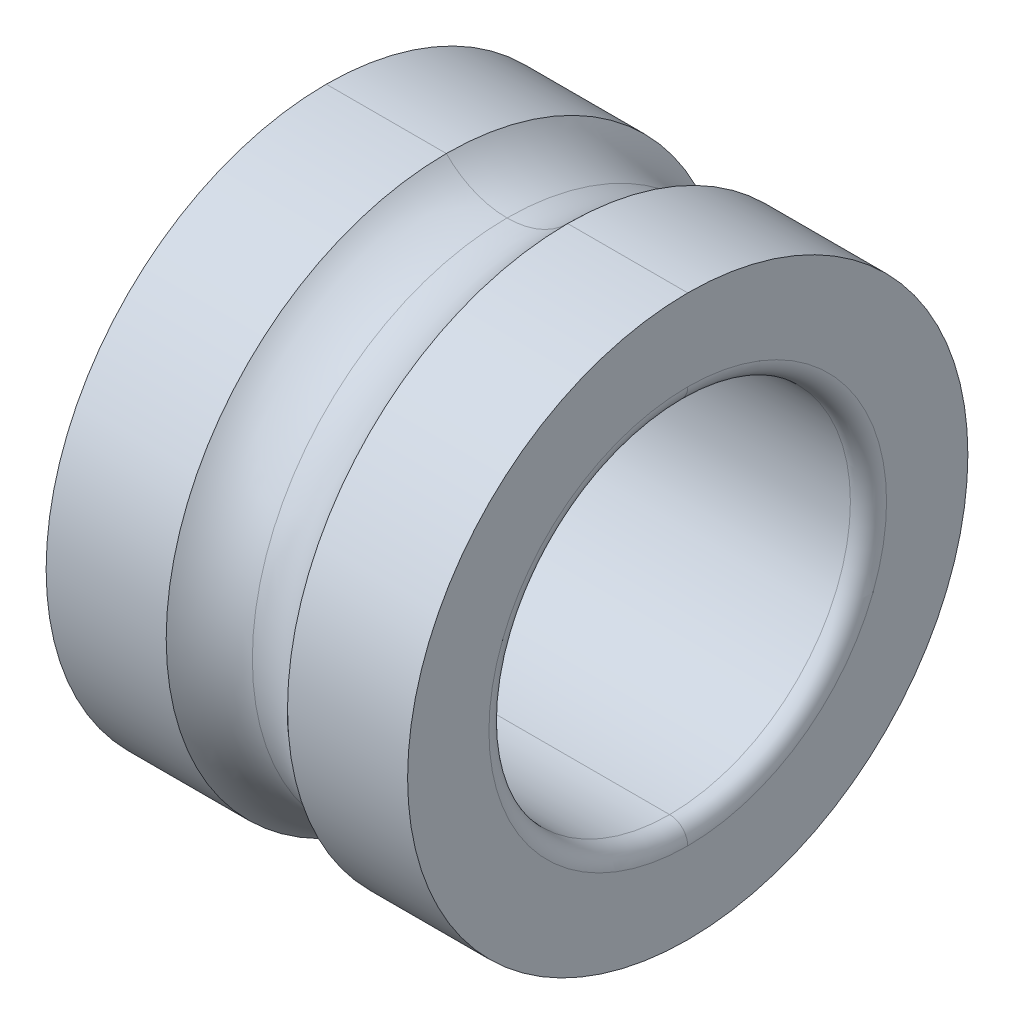
ISO-10303-21;
HEADER;
FILE_DESCRIPTION(('STEP AP214'),'2;1');
FILE_NAME('part.step','',(''),(''),'','','');
FILE_SCHEMA(('AUTOMOTIVE_DESIGN { 1 0 10303 214 1 1 1 1 }'));
ENDSEC;
DATA;
#1=APPLICATION_CONTEXT('core data for automotive mechanical design processes');
#2=APPLICATION_PROTOCOL_DEFINITION('international standard','automotive_design',2000,#1);
#3=PRODUCT_CONTEXT('',#1,'mechanical');
#4=PRODUCT('Part','Part','',(#3));
#5=PRODUCT_RELATED_PRODUCT_CATEGORY('part','',(#4));
#6=PRODUCT_DEFINITION_FORMATION('','',#4);
#7=PRODUCT_DEFINITION_CONTEXT('part definition',#1,'design');
#8=PRODUCT_DEFINITION('design','',#6,#7);
#9=PRODUCT_DEFINITION_SHAPE('','',#8);
#10=(LENGTH_UNIT() NAMED_UNIT(*) SI_UNIT(.MILLI.,.METRE.));
#11=(NAMED_UNIT(*) PLANE_ANGLE_UNIT() SI_UNIT($,.RADIAN.));
#12=(NAMED_UNIT(*) SI_UNIT($,.STERADIAN.) SOLID_ANGLE_UNIT());
#13=UNCERTAINTY_MEASURE_WITH_UNIT(LENGTH_MEASURE(1.E-05),#10,'distance_accuracy_value','');
#14=(GEOMETRIC_REPRESENTATION_CONTEXT(3) GLOBAL_UNCERTAINTY_ASSIGNED_CONTEXT((#13)) GLOBAL_UNIT_ASSIGNED_CONTEXT((#10,
#11,#12)) REPRESENTATION_CONTEXT('',''));
#15=CARTESIAN_POINT('',(0.,0.,0.));
#16=DIRECTION('',(0.,0.,1.));
#17=DIRECTION('',(1.,0.,0.));
#18=AXIS2_PLACEMENT_3D('',#15,#16,#17);
#19=CARTESIAN_POINT('',(-1.79451,0.,0.));
#20=DIRECTION('',(1.,0.,0.));
#21=DIRECTION('',(0.,-1.,0.));
#22=AXIS2_PLACEMENT_3D('',#19,#20,#21);
#23=TOROIDAL_SURFACE('',#22,2.19329,0.19939);
#24=CARTESIAN_POINT('',(-1.9939,0.,0.));
#25=DIRECTION('',(-1.,0.,0.));
#26=DIRECTION('',(0.,1.,0.));
#27=AXIS2_PLACEMENT_3D('',#24,#25,#26);
#28=CIRCLE('',#27,2.19329);
#29=CARTESIAN_POINT('',(-1.9939,2.19329,0.));
#30=VERTEX_POINT('',#29);
#31=CARTESIAN_POINT('',(-1.9939,-2.19329,0.));
#32=VERTEX_POINT('',#31);
#33=EDGE_CURVE('E111',#30,#32,#28,.T.);
#34=ORIENTED_EDGE('',*,*,#33,.T.);
#35=CARTESIAN_POINT('',(-1.79451,-2.19329,0.));
#36=DIRECTION('',(0.,0.,-1.));
#37=DIRECTION('',(-1.,0.,0.));
#38=AXIS2_PLACEMENT_3D('',#35,#36,#37);
#39=CIRCLE('',#38,0.19939);
#40=CARTESIAN_POINT('',(-1.79451,-1.9939,0.));
#41=VERTEX_POINT('',#40);
#42=EDGE_CURVE('E28',#32,#41,#39,.T.);
#43=ORIENTED_EDGE('',*,*,#42,.T.);
#44=CARTESIAN_POINT('',(-1.79451,0.,0.));
#45=DIRECTION('',(-1.,0.,0.));
#46=DIRECTION('',(0.,1.,0.));
#47=AXIS2_PLACEMENT_3D('',#44,#45,#46);
#48=CIRCLE('',#47,1.9939);
#49=CARTESIAN_POINT('',(-1.79451,1.9939,0.));
#50=VERTEX_POINT('',#49);
#51=EDGE_CURVE('E174',#50,#41,#48,.T.);
#52=ORIENTED_EDGE('',*,*,#51,.F.);
#53=CARTESIAN_POINT('',(-1.79451,2.19329,0.));
#54=DIRECTION('',(0.,0.,1.));
#55=DIRECTION('',(-1.,0.,0.));
#56=AXIS2_PLACEMENT_3D('',#53,#54,#55);
#57=CIRCLE('',#56,0.19939);
#58=EDGE_CURVE('E11',#30,#50,#57,.T.);
#59=ORIENTED_EDGE('',*,*,#58,.F.);
#60=EDGE_LOOP('',(#34,#43,#52,#59));
#61=FACE_BOUND('',#60,.T.);
#62=ADVANCED_FACE('F17',(#61),#23,.T.);
#63=CARTESIAN_POINT('',(-1.79451,0.,0.));
#64=DIRECTION('',(1.,0.,0.));
#65=DIRECTION('',(0.,-1.,0.));
#66=AXIS2_PLACEMENT_3D('',#63,#64,#65);
#67=TOROIDAL_SURFACE('',#66,2.19329,0.19939);
#68=CARTESIAN_POINT('',(-1.79451,0.,0.));
#69=DIRECTION('',(1.,0.,0.));
#70=DIRECTION('',(0.,1.,0.));
#71=AXIS2_PLACEMENT_3D('',#68,#69,#70);
#72=CIRCLE('',#71,1.9939);
#73=EDGE_CURVE('E151',#50,#41,#72,.T.);
#74=ORIENTED_EDGE('',*,*,#73,.T.);
#75=ORIENTED_EDGE('',*,*,#42,.F.);
#76=CARTESIAN_POINT('',(-1.9939,0.,0.));
#77=DIRECTION('',(1.,0.,0.));
#78=DIRECTION('',(0.,1.,0.));
#79=AXIS2_PLACEMENT_3D('',#76,#77,#78);
#80=CIRCLE('',#79,2.19329);
#81=EDGE_CURVE('E182',#30,#32,#80,.T.);
#82=ORIENTED_EDGE('',*,*,#81,.F.);
#83=ORIENTED_EDGE('',*,*,#58,.T.);
#84=EDGE_LOOP('',(#74,#75,#82,#83));
#85=FACE_BOUND('',#84,.T.);
#86=ADVANCED_FACE('F19',(#85),#67,.T.);
#87=CARTESIAN_POINT('',(-1.9939,0.,0.));
#88=DIRECTION('',(1.,0.,0.));
#89=DIRECTION('',(0.,1.,0.));
#90=AXIS2_PLACEMENT_3D('',#87,#88,#89);
#91=PLANE('',#90);
#92=ORIENTED_EDGE('',*,*,#33,.F.);
#93=ORIENTED_EDGE('',*,*,#81,.T.);
#94=EDGE_LOOP('',(#92,#93));
#95=FACE_BOUND('',#94,.T.);
#96=CARTESIAN_POINT('',(-1.9939,0.,0.));
#97=DIRECTION('',(1.,0.,0.));
#98=DIRECTION('',(0.,1.,0.));
#99=AXIS2_PLACEMENT_3D('',#96,#97,#98);
#100=CIRCLE('',#99,3.0905069);
#101=CARTESIAN_POINT('',(-1.9939,3.0905069,0.));
#102=VERTEX_POINT('',#101);
#103=CARTESIAN_POINT('',(-1.9939,-3.0905069,0.));
#104=VERTEX_POINT('',#103);
#105=EDGE_CURVE('E115',#102,#104,#100,.T.);
#106=ORIENTED_EDGE('',*,*,#105,.F.);
#107=CARTESIAN_POINT('',(-1.9939,0.,0.));
#108=DIRECTION('',(-1.,0.,0.));
#109=DIRECTION('',(0.,1.,0.));
#110=AXIS2_PLACEMENT_3D('',#107,#108,#109);
#111=CIRCLE('',#110,3.0905069);
#112=EDGE_CURVE('E104',#102,#104,#111,.T.);
#113=ORIENTED_EDGE('',*,*,#112,.T.);
#114=EDGE_LOOP('',(#106,#113));
#115=FACE_BOUND('',#114,.T.);
#116=ADVANCED_FACE('F121',(#95,#115),#91,.F.);
#117=CARTESIAN_POINT('',(-2.19329,0.,0.));
#118=DIRECTION('',(1.,0.,0.));
#119=DIRECTION('',(0.,-1.,0.));
#120=AXIS2_PLACEMENT_3D('',#117,#118,#119);
#121=CYLINDRICAL_SURFACE('',#120,3.0905069);
#122=CARTESIAN_POINT('',(-0.669246824752564,0.,0.));
#123=DIRECTION('',(-1.,0.,0.));
#124=DIRECTION('',(0.,1.,0.));
#125=AXIS2_PLACEMENT_3D('',#122,#123,#124);
#126=CIRCLE('',#125,3.0905069);
#127=CARTESIAN_POINT('',(-0.669246824752564,3.0905069,0.));
#128=VERTEX_POINT('',#127);
#129=CARTESIAN_POINT('',(-0.669246824752564,-3.0905069,0.));
#130=VERTEX_POINT('',#129);
#131=EDGE_CURVE('E139',#128,#130,#126,.T.);
#132=ORIENTED_EDGE('',*,*,#131,.T.);
#133=DIRECTION('',(-1.,0.,0.));
#134=VECTOR('',#133,1.);
#135=CARTESIAN_POINT('',(-0.669246824752564,-3.0905069,0.));
#136=LINE('',#135,#134);
#137=EDGE_CURVE('E106',#130,#104,#136,.T.);
#138=ORIENTED_EDGE('',*,*,#137,.T.);
#139=ORIENTED_EDGE('',*,*,#112,.F.);
#140=DIRECTION('',(-1.,0.,0.));
#141=VECTOR('',#140,1.);
#142=CARTESIAN_POINT('',(-0.669246824752564,3.0905069,0.));
#143=LINE('',#142,#141);
#144=EDGE_CURVE('E98',#128,#102,#143,.T.);
#145=ORIENTED_EDGE('',*,*,#144,.F.);
#146=EDGE_LOOP('',(#132,#138,#139,#145));
#147=FACE_BOUND('',#146,.T.);
#148=ADVANCED_FACE('F105',(#147),#121,.T.);
#149=CARTESIAN_POINT('',(-2.19329,0.,0.));
#150=DIRECTION('',(1.,0.,0.));
#151=DIRECTION('',(0.,-1.,0.));
#152=AXIS2_PLACEMENT_3D('',#149,#150,#151);
#153=CYLINDRICAL_SURFACE('',#152,3.0905069);
#154=ORIENTED_EDGE('',*,*,#105,.T.);
#155=ORIENTED_EDGE('',*,*,#137,.F.);
#156=CARTESIAN_POINT('',(-0.669246824752564,0.,0.));
#157=DIRECTION('',(1.,0.,0.));
#158=DIRECTION('',(0.,1.,0.));
#159=AXIS2_PLACEMENT_3D('',#156,#157,#158);
#160=CIRCLE('',#159,3.0905069);
#161=EDGE_CURVE('E117',#128,#130,#160,.T.);
#162=ORIENTED_EDGE('',*,*,#161,.F.);
#163=ORIENTED_EDGE('',*,*,#144,.T.);
#164=EDGE_LOOP('',(#154,#155,#162,#163));
#165=FACE_BOUND('',#164,.T.);
#166=ADVANCED_FACE('F114',(#165),#153,.T.);
#167=CARTESIAN_POINT('',(0.,0.,0.));
#168=DIRECTION('',(1.,0.,0.));
#169=DIRECTION('',(0.,-1.,0.));
#170=AXIS2_PLACEMENT_3D('',#167,#168,#169);
#171=TOROIDAL_SURFACE('',#170,3.7465,0.937133);
#172=CARTESIAN_POINT('',(0.,0.,0.));
#173=DIRECTION('',(1.,0.,0.));
#174=DIRECTION('',(0.,0.,-1.));
#175=AXIS2_PLACEMENT_3D('',#172,#173,#174);
#176=CIRCLE('',#175,2.809367);
#177=CARTESIAN_POINT('',(0.,2.809367,0.));
#178=VERTEX_POINT('',#177);
#179=CARTESIAN_POINT('',(0.,-2.809367,0.));
#180=VERTEX_POINT('',#179);
#181=EDGE_CURVE('E155',#178,#180,#176,.T.);
#182=ORIENTED_EDGE('',*,*,#181,.F.);
#183=CARTESIAN_POINT('',(0.,3.7465,0.));
#184=DIRECTION('',(0.,0.,-1.));
#185=DIRECTION('',(0.714142842854284,-0.7,0.));
#186=AXIS2_PLACEMENT_3D('',#183,#184,#185);
#187=CIRCLE('',#186,0.937133);
#188=EDGE_CURVE('E130',#178,#128,#187,.T.);
#189=ORIENTED_EDGE('',*,*,#188,.T.);
#190=ORIENTED_EDGE('',*,*,#161,.T.);
#191=CARTESIAN_POINT('',(0.,-3.7465,0.));
#192=DIRECTION('',(0.,0.,1.));
#193=DIRECTION('',(0.714142842854284,0.7,0.));
#194=AXIS2_PLACEMENT_3D('',#191,#192,#193);
#195=CIRCLE('',#194,0.937133);
#196=EDGE_CURVE('E135',#180,#130,#195,.T.);
#197=ORIENTED_EDGE('',*,*,#196,.F.);
#198=EDGE_LOOP('',(#182,#189,#190,#197));
#199=FACE_BOUND('',#198,.T.);
#200=ADVANCED_FACE('F267',(#199),#171,.F.);
#201=CARTESIAN_POINT('',(0.,0.,0.));
#202=DIRECTION('',(1.,0.,0.));
#203=DIRECTION('',(0.,-1.,0.));
#204=AXIS2_PLACEMENT_3D('',#201,#202,#203);
#205=TOROIDAL_SURFACE('',#204,3.7465,0.937133);
#206=CARTESIAN_POINT('',(0.,0.,0.));
#207=DIRECTION('',(1.,0.,0.));
#208=DIRECTION('',(0.,0.,-1.));
#209=AXIS2_PLACEMENT_3D('',#206,#207,#208);
#210=CIRCLE('',#209,2.809367);
#211=EDGE_CURVE('E165',#180,#178,#210,.T.);
#212=ORIENTED_EDGE('',*,*,#211,.F.);
#213=ORIENTED_EDGE('',*,*,#196,.T.);
#214=ORIENTED_EDGE('',*,*,#131,.F.);
#215=ORIENTED_EDGE('',*,*,#188,.F.);
#216=EDGE_LOOP('',(#212,#213,#214,#215));
#217=FACE_BOUND('',#216,.T.);
#218=ADVANCED_FACE('F271',(#217),#205,.F.);
#219=CARTESIAN_POINT('',(-2.19329,0.,0.));
#220=DIRECTION('',(1.,0.,0.));
#221=DIRECTION('',(0.,-1.,0.));
#222=AXIS2_PLACEMENT_3D('',#219,#220,#221);
#223=CYLINDRICAL_SURFACE('',#222,3.0905069);
#224=CARTESIAN_POINT('',(1.9939,0.,0.));
#225=DIRECTION('',(-1.,0.,0.));
#226=DIRECTION('',(0.,1.,0.));
#227=AXIS2_PLACEMENT_3D('',#224,#225,#226);
#228=CIRCLE('',#227,3.0905069);
#229=CARTESIAN_POINT('',(1.9939,3.0905069,0.));
#230=VERTEX_POINT('',#229);
#231=CARTESIAN_POINT('',(1.9939,-3.0905069,0.));
#232=VERTEX_POINT('',#231);
#233=EDGE_CURVE('E193',#230,#232,#228,.T.);
#234=ORIENTED_EDGE('',*,*,#233,.T.);
#235=DIRECTION('',(-1.,0.,0.));
#236=VECTOR('',#235,1.);
#237=CARTESIAN_POINT('',(1.9939,-3.0905069,0.));
#238=LINE('',#237,#236);
#239=CARTESIAN_POINT('',(0.669246824752564,-3.0905069,0.));
#240=VERTEX_POINT('',#239);
#241=EDGE_CURVE('E178',#232,#240,#238,.T.);
#242=ORIENTED_EDGE('',*,*,#241,.T.);
#243=CARTESIAN_POINT('',(0.669246824752564,0.,0.));
#244=DIRECTION('',(-1.,0.,0.));
#245=DIRECTION('',(0.,1.,0.));
#246=AXIS2_PLACEMENT_3D('',#243,#244,#245);
#247=CIRCLE('',#246,3.0905069);
#248=CARTESIAN_POINT('',(0.669246824752564,3.0905069,0.));
#249=VERTEX_POINT('',#248);
#250=EDGE_CURVE('E169',#249,#240,#247,.T.);
#251=ORIENTED_EDGE('',*,*,#250,.F.);
#252=DIRECTION('',(-1.,0.,0.));
#253=VECTOR('',#252,1.);
#254=CARTESIAN_POINT('',(1.9939,3.0905069,0.));
#255=LINE('',#254,#253);
#256=EDGE_CURVE('E140',#230,#249,#255,.T.);
#257=ORIENTED_EDGE('',*,*,#256,.F.);
#258=EDGE_LOOP('',(#234,#242,#251,#257));
#259=FACE_BOUND('',#258,.T.);
#260=ADVANCED_FACE('F286',(#259),#223,.T.);
#261=CARTESIAN_POINT('',(-2.19329,0.,0.));
#262=DIRECTION('',(1.,0.,0.));
#263=DIRECTION('',(0.,-1.,0.));
#264=AXIS2_PLACEMENT_3D('',#261,#262,#263);
#265=CYLINDRICAL_SURFACE('',#264,3.0905069);
#266=CARTESIAN_POINT('',(0.669246824752564,0.,0.));
#267=DIRECTION('',(1.,0.,0.));
#268=DIRECTION('',(0.,1.,0.));
#269=AXIS2_PLACEMENT_3D('',#266,#267,#268);
#270=CIRCLE('',#269,3.0905069);
#271=EDGE_CURVE('E164',#249,#240,#270,.T.);
#272=ORIENTED_EDGE('',*,*,#271,.T.);
#273=ORIENTED_EDGE('',*,*,#241,.F.);
#274=CARTESIAN_POINT('',(1.9939,0.,0.));
#275=DIRECTION('',(1.,0.,0.));
#276=DIRECTION('',(0.,1.,0.));
#277=AXIS2_PLACEMENT_3D('',#274,#275,#276);
#278=CIRCLE('',#277,3.0905069);
#279=EDGE_CURVE('E21',#230,#232,#278,.T.);
#280=ORIENTED_EDGE('',*,*,#279,.F.);
#281=ORIENTED_EDGE('',*,*,#256,.T.);
#282=EDGE_LOOP('',(#272,#273,#280,#281));
#283=FACE_BOUND('',#282,.T.);
#284=ADVANCED_FACE('F258',(#283),#265,.T.);
#285=CARTESIAN_POINT('',(1.9939,0.,0.));
#286=DIRECTION('',(1.,0.,0.));
#287=DIRECTION('',(0.,1.,0.));
#288=AXIS2_PLACEMENT_3D('',#285,#286,#287);
#289=PLANE('',#288);
#290=CARTESIAN_POINT('',(1.9939,0.,0.));
#291=DIRECTION('',(1.,0.,0.));
#292=DIRECTION('',(0.,1.,0.));
#293=AXIS2_PLACEMENT_3D('',#290,#291,#292);
#294=CIRCLE('',#293,2.19329);
#295=CARTESIAN_POINT('',(1.9939,2.19329,0.));
#296=VERTEX_POINT('',#295);
#297=CARTESIAN_POINT('',(1.9939,-2.19329,0.));
#298=VERTEX_POINT('',#297);
#299=EDGE_CURVE('E146',#296,#298,#294,.T.);
#300=ORIENTED_EDGE('',*,*,#299,.F.);
#301=CARTESIAN_POINT('',(1.9939,0.,0.));
#302=DIRECTION('',(-1.,0.,0.));
#303=DIRECTION('',(0.,1.,0.));
#304=AXIS2_PLACEMENT_3D('',#301,#302,#303);
#305=CIRCLE('',#304,2.19329);
#306=EDGE_CURVE('E197',#296,#298,#305,.T.);
#307=ORIENTED_EDGE('',*,*,#306,.T.);
#308=EDGE_LOOP('',(#300,#307));
#309=FACE_BOUND('',#308,.T.);
#310=ORIENTED_EDGE('',*,*,#233,.F.);
#311=ORIENTED_EDGE('',*,*,#279,.T.);
#312=EDGE_LOOP('',(#310,#311));
#313=FACE_BOUND('',#312,.T.);
#314=ADVANCED_FACE('F285',(#309,#313),#289,.T.);
#315=CARTESIAN_POINT('',(1.79451,0.,0.));
#316=DIRECTION('',(1.,0.,0.));
#317=DIRECTION('',(0.,-1.,0.));
#318=AXIS2_PLACEMENT_3D('',#315,#316,#317);
#319=TOROIDAL_SURFACE('',#318,2.19329,0.19939);
#320=CARTESIAN_POINT('',(1.79451,0.,0.));
#321=DIRECTION('',(-1.,0.,0.));
#322=DIRECTION('',(0.,1.,0.));
#323=AXIS2_PLACEMENT_3D('',#320,#321,#322);
#324=CIRCLE('',#323,1.9939);
#325=CARTESIAN_POINT('',(1.79451,1.9939,0.));
#326=VERTEX_POINT('',#325);
#327=CARTESIAN_POINT('',(1.79451,-1.9939,0.));
#328=VERTEX_POINT('',#327);
#329=EDGE_CURVE('E133',#326,#328,#324,.T.);
#330=ORIENTED_EDGE('',*,*,#329,.T.);
#331=CARTESIAN_POINT('',(1.79451,-2.19329,0.));
#332=DIRECTION('',(0.,0.,-1.));
#333=DIRECTION('',(0.,1.,0.));
#334=AXIS2_PLACEMENT_3D('',#331,#332,#333);
#335=CIRCLE('',#334,0.19939);
#336=EDGE_CURVE('E150',#328,#298,#335,.T.);
#337=ORIENTED_EDGE('',*,*,#336,.T.);
#338=ORIENTED_EDGE('',*,*,#306,.F.);
#339=CARTESIAN_POINT('',(1.79451,2.19329,0.));
#340=DIRECTION('',(0.,0.,1.));
#341=DIRECTION('',(0.,-1.,0.));
#342=AXIS2_PLACEMENT_3D('',#339,#340,#341);
#343=CIRCLE('',#342,0.19939);
#344=EDGE_CURVE('E200',#326,#296,#343,.T.);
#345=ORIENTED_EDGE('',*,*,#344,.F.);
#346=EDGE_LOOP('',(#330,#337,#338,#345));
#347=FACE_BOUND('',#346,.T.);
#348=ADVANCED_FACE('F308',(#347),#319,.T.);
#349=CARTESIAN_POINT('',(1.79451,0.,0.));
#350=DIRECTION('',(1.,0.,0.));
#351=DIRECTION('',(0.,-1.,0.));
#352=AXIS2_PLACEMENT_3D('',#349,#350,#351);
#353=TOROIDAL_SURFACE('',#352,2.19329,0.19939);
#354=ORIENTED_EDGE('',*,*,#299,.T.);
#355=ORIENTED_EDGE('',*,*,#336,.F.);
#356=CARTESIAN_POINT('',(1.79451,0.,0.));
#357=DIRECTION('',(1.,0.,0.));
#358=DIRECTION('',(0.,1.,0.));
#359=AXIS2_PLACEMENT_3D('',#356,#357,#358);
#360=CIRCLE('',#359,1.9939);
#361=EDGE_CURVE('E145',#326,#328,#360,.T.);
#362=ORIENTED_EDGE('',*,*,#361,.F.);
#363=ORIENTED_EDGE('',*,*,#344,.T.);
#364=EDGE_LOOP('',(#354,#355,#362,#363));
#365=FACE_BOUND('',#364,.T.);
#366=ADVANCED_FACE('F234',(#365),#353,.T.);
#367=CARTESIAN_POINT('',(-2.19329,0.,0.));
#368=DIRECTION('',(1.,0.,0.));
#369=DIRECTION('',(0.,-1.,0.));
#370=AXIS2_PLACEMENT_3D('',#367,#368,#369);
#371=CYLINDRICAL_SURFACE('',#370,1.9939);
#372=ORIENTED_EDGE('',*,*,#361,.T.);
#373=DIRECTION('',(1.,0.,0.));
#374=VECTOR('',#373,1.);
#375=CARTESIAN_POINT('',(-1.79451,-1.9939,0.));
#376=LINE('',#375,#374);
#377=EDGE_CURVE('E170',#41,#328,#376,.T.);
#378=ORIENTED_EDGE('',*,*,#377,.F.);
#379=ORIENTED_EDGE('',*,*,#73,.F.);
#380=DIRECTION('',(1.,0.,0.));
#381=VECTOR('',#380,1.);
#382=CARTESIAN_POINT('',(-1.79451,1.9939,0.));
#383=LINE('',#382,#381);
#384=EDGE_CURVE('E141',#50,#326,#383,.T.);
#385=ORIENTED_EDGE('',*,*,#384,.T.);
#386=EDGE_LOOP('',(#372,#378,#379,#385));
#387=FACE_BOUND('',#386,.T.);
#388=ADVANCED_FACE('F213',(#387),#371,.F.);
#389=CARTESIAN_POINT('',(-2.19329,0.,0.));
#390=DIRECTION('',(1.,0.,0.));
#391=DIRECTION('',(0.,-1.,0.));
#392=AXIS2_PLACEMENT_3D('',#389,#390,#391);
#393=CYLINDRICAL_SURFACE('',#392,1.9939);
#394=ORIENTED_EDGE('',*,*,#51,.T.);
#395=ORIENTED_EDGE('',*,*,#377,.T.);
#396=ORIENTED_EDGE('',*,*,#329,.F.);
#397=ORIENTED_EDGE('',*,*,#384,.F.);
#398=EDGE_LOOP('',(#394,#395,#396,#397));
#399=FACE_BOUND('',#398,.T.);
#400=ADVANCED_FACE('F218',(#399),#393,.F.);
#401=CARTESIAN_POINT('',(0.,0.,0.));
#402=DIRECTION('',(1.,0.,0.));
#403=DIRECTION('',(0.,-1.,0.));
#404=AXIS2_PLACEMENT_3D('',#401,#402,#403);
#405=TOROIDAL_SURFACE('',#404,3.7465,0.937133);
#406=CARTESIAN_POINT('',(0.,-3.7465,0.));
#407=DIRECTION('',(0.,0.,1.));
#408=DIRECTION('',(0.714142842854284,0.7,0.));
#409=AXIS2_PLACEMENT_3D('',#406,#407,#408);
#410=CIRCLE('',#409,0.937133);
#411=EDGE_CURVE('E159',#240,#180,#410,.T.);
#412=ORIENTED_EDGE('',*,*,#411,.T.);
#413=ORIENTED_EDGE('',*,*,#211,.T.);
#414=CARTESIAN_POINT('',(0.,3.7465,0.));
#415=DIRECTION('',(0.,0.,-1.));
#416=DIRECTION('',(0.714142842854284,-0.7,0.));
#417=AXIS2_PLACEMENT_3D('',#414,#415,#416);
#418=CIRCLE('',#417,0.937133);
#419=EDGE_CURVE('E160',#249,#178,#418,.T.);
#420=ORIENTED_EDGE('',*,*,#419,.F.);
#421=ORIENTED_EDGE('',*,*,#250,.T.);
#422=EDGE_LOOP('',(#412,#413,#420,#421));
#423=FACE_BOUND('',#422,.T.);
#424=ADVANCED_FACE('F253',(#423),#405,.F.);
#425=CARTESIAN_POINT('',(0.,0.,0.));
#426=DIRECTION('',(1.,0.,0.));
#427=DIRECTION('',(0.,-1.,0.));
#428=AXIS2_PLACEMENT_3D('',#425,#426,#427);
#429=TOROIDAL_SURFACE('',#428,3.7465,0.937133);
#430=ORIENTED_EDGE('',*,*,#419,.T.);
#431=ORIENTED_EDGE('',*,*,#181,.T.);
#432=ORIENTED_EDGE('',*,*,#411,.F.);
#433=ORIENTED_EDGE('',*,*,#271,.F.);
#434=EDGE_LOOP('',(#430,#431,#432,#433));
#435=FACE_BOUND('',#434,.T.);
#436=ADVANCED_FACE('F264',(#435),#429,.F.);
#437=CLOSED_SHELL('',(#62,#86,#116,#148,#166,#200,#218,#260,#284,#314,#348,#366,#388,#400,#424,#436));
#438=MANIFOLD_SOLID_BREP('B1',#437);
#439=ADVANCED_BREP_SHAPE_REPRESENTATION('',(#18,#438),#14);
#440=SHAPE_DEFINITION_REPRESENTATION(#9,#439);
ENDSEC;
END-ISO-10303-21;
